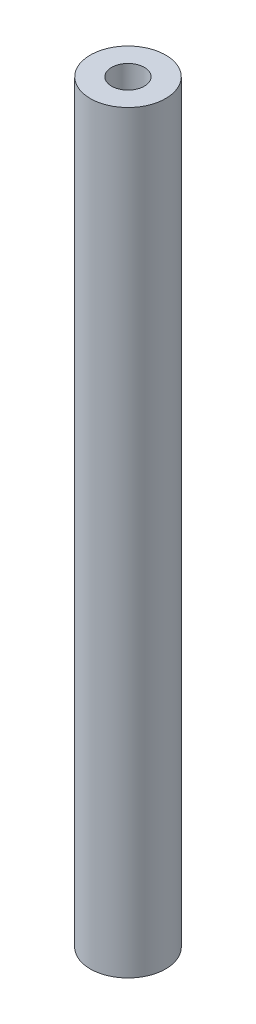
ISO-10303-21;
HEADER;
FILE_DESCRIPTION(('STEP AP214'),'2;1');
FILE_NAME('part.step','',(''),(''),'','','');
FILE_SCHEMA(('AUTOMOTIVE_DESIGN { 1 0 10303 214 1 1 1 1 }'));
ENDSEC;
DATA;
#1=APPLICATION_CONTEXT('core data for automotive mechanical design processes');
#2=APPLICATION_PROTOCOL_DEFINITION('international standard','automotive_design',2000,#1);
#3=PRODUCT_CONTEXT('',#1,'mechanical');
#4=PRODUCT('Part','Part','',(#3));
#5=PRODUCT_RELATED_PRODUCT_CATEGORY('part','',(#4));
#6=PRODUCT_DEFINITION_FORMATION('','',#4);
#7=PRODUCT_DEFINITION_CONTEXT('part definition',#1,'design');
#8=PRODUCT_DEFINITION('design','',#6,#7);
#9=PRODUCT_DEFINITION_SHAPE('','',#8);
#10=(LENGTH_UNIT() NAMED_UNIT(*) SI_UNIT(.MILLI.,.METRE.));
#11=(NAMED_UNIT(*) PLANE_ANGLE_UNIT() SI_UNIT($,.RADIAN.));
#12=(NAMED_UNIT(*) SI_UNIT($,.STERADIAN.) SOLID_ANGLE_UNIT());
#13=UNCERTAINTY_MEASURE_WITH_UNIT(LENGTH_MEASURE(1.E-05),#10,'distance_accuracy_value','');
#14=(GEOMETRIC_REPRESENTATION_CONTEXT(3) GLOBAL_UNCERTAINTY_ASSIGNED_CONTEXT((#13)) GLOBAL_UNIT_ASSIGNED_CONTEXT((#10,
#11,#12)) REPRESENTATION_CONTEXT('',''));
#15=CARTESIAN_POINT('',(0.,0.,0.));
#16=DIRECTION('',(0.,0.,1.));
#17=DIRECTION('',(1.,0.,0.));
#18=AXIS2_PLACEMENT_3D('',#15,#16,#17);
#19=CARTESIAN_POINT('',(0.,70.,0.));
#20=DIRECTION('',(0.,1.,0.));
#21=DIRECTION('',(0.,0.,1.));
#22=AXIS2_PLACEMENT_3D('',#19,#20,#21);
#23=PLANE('',#22);
#24=CARTESIAN_POINT('',(0.,70.,0.));
#25=DIRECTION('',(0.,1.,0.));
#26=DIRECTION('',(0.,0.,1.));
#27=AXIS2_PLACEMENT_3D('',#24,#25,#26);
#28=CIRCLE('',#27,3.5);
#29=CARTESIAN_POINT('',(0.,70.,3.5));
#30=VERTEX_POINT('',#29);
#31=EDGE_CURVE('E10',#30,#30,#28,.T.);
#32=ORIENTED_EDGE('',*,*,#31,.T.);
#33=EDGE_LOOP('',(#32));
#34=FACE_BOUND('',#33,.T.);
#35=CARTESIAN_POINT('',(0.,70.,0.));
#36=DIRECTION('',(0.,1.,0.));
#37=DIRECTION('',(0.,0.,1.));
#38=AXIS2_PLACEMENT_3D('',#35,#36,#37);
#39=CIRCLE('',#38,1.52);
#40=CARTESIAN_POINT('',(0.,70.,1.52));
#41=VERTEX_POINT('',#40);
#42=EDGE_CURVE('E47',#41,#41,#39,.T.);
#43=ORIENTED_EDGE('',*,*,#42,.F.);
#44=EDGE_LOOP('',(#43));
#45=FACE_BOUND('',#44,.T.);
#46=ADVANCED_FACE('F36',(#34,#45),#23,.T.);
#47=CARTESIAN_POINT('',(0.,0.,0.));
#48=DIRECTION('',(0.,1.,0.));
#49=DIRECTION('',(0.,0.,1.));
#50=AXIS2_PLACEMENT_3D('',#47,#48,#49);
#51=PLANE('',#50);
#52=CARTESIAN_POINT('',(0.,0.,0.));
#53=DIRECTION('',(0.,1.,0.));
#54=DIRECTION('',(0.,0.,1.));
#55=AXIS2_PLACEMENT_3D('',#52,#53,#54);
#56=CIRCLE('',#55,3.5);
#57=CARTESIAN_POINT('',(0.,0.,3.5));
#58=VERTEX_POINT('',#57);
#59=EDGE_CURVE('E40',#58,#58,#56,.T.);
#60=ORIENTED_EDGE('',*,*,#59,.F.);
#61=EDGE_LOOP('',(#60));
#62=FACE_BOUND('',#61,.T.);
#63=CARTESIAN_POINT('',(0.,0.,0.));
#64=DIRECTION('',(0.,1.,0.));
#65=DIRECTION('',(0.,0.,1.));
#66=AXIS2_PLACEMENT_3D('',#63,#64,#65);
#67=CIRCLE('',#66,1.52);
#68=CARTESIAN_POINT('',(0.,0.,1.52));
#69=VERTEX_POINT('',#68);
#70=EDGE_CURVE('E49',#69,#69,#67,.T.);
#71=ORIENTED_EDGE('',*,*,#70,.T.);
#72=EDGE_LOOP('',(#71));
#73=FACE_BOUND('',#72,.T.);
#74=ADVANCED_FACE('F59',(#62,#73),#51,.F.);
#75=CARTESIAN_POINT('',(0.,70.,0.));
#76=DIRECTION('',(0.,-1.,0.));
#77=DIRECTION('',(0.,0.,-1.));
#78=AXIS2_PLACEMENT_3D('',#75,#76,#77);
#79=CYLINDRICAL_SURFACE('',#78,3.5);
#80=ORIENTED_EDGE('',*,*,#31,.F.);
#81=EDGE_LOOP('',(#80));
#82=FACE_BOUND('',#81,.T.);
#83=ORIENTED_EDGE('',*,*,#59,.T.);
#84=EDGE_LOOP('',(#83));
#85=FACE_BOUND('',#84,.T.);
#86=ADVANCED_FACE('F38',(#82,#85),#79,.T.);
#87=CARTESIAN_POINT('',(0.,70.,0.));
#88=DIRECTION('',(0.,-1.,0.));
#89=DIRECTION('',(0.,0.,-1.));
#90=AXIS2_PLACEMENT_3D('',#87,#88,#89);
#91=CYLINDRICAL_SURFACE('',#90,1.52);
#92=ORIENTED_EDGE('',*,*,#42,.T.);
#93=EDGE_LOOP('',(#92));
#94=FACE_BOUND('',#93,.T.);
#95=ORIENTED_EDGE('',*,*,#70,.F.);
#96=EDGE_LOOP('',(#95));
#97=FACE_BOUND('',#96,.T.);
#98=ADVANCED_FACE('F55',(#94,#97),#91,.F.);
#99=CLOSED_SHELL('',(#46,#74,#86,#98));
#100=MANIFOLD_SOLID_BREP('B2',#99);
#101=ADVANCED_BREP_SHAPE_REPRESENTATION('',(#18,#100),#14);
#102=SHAPE_DEFINITION_REPRESENTATION(#9,#101);
ENDSEC;
END-ISO-10303-21;
